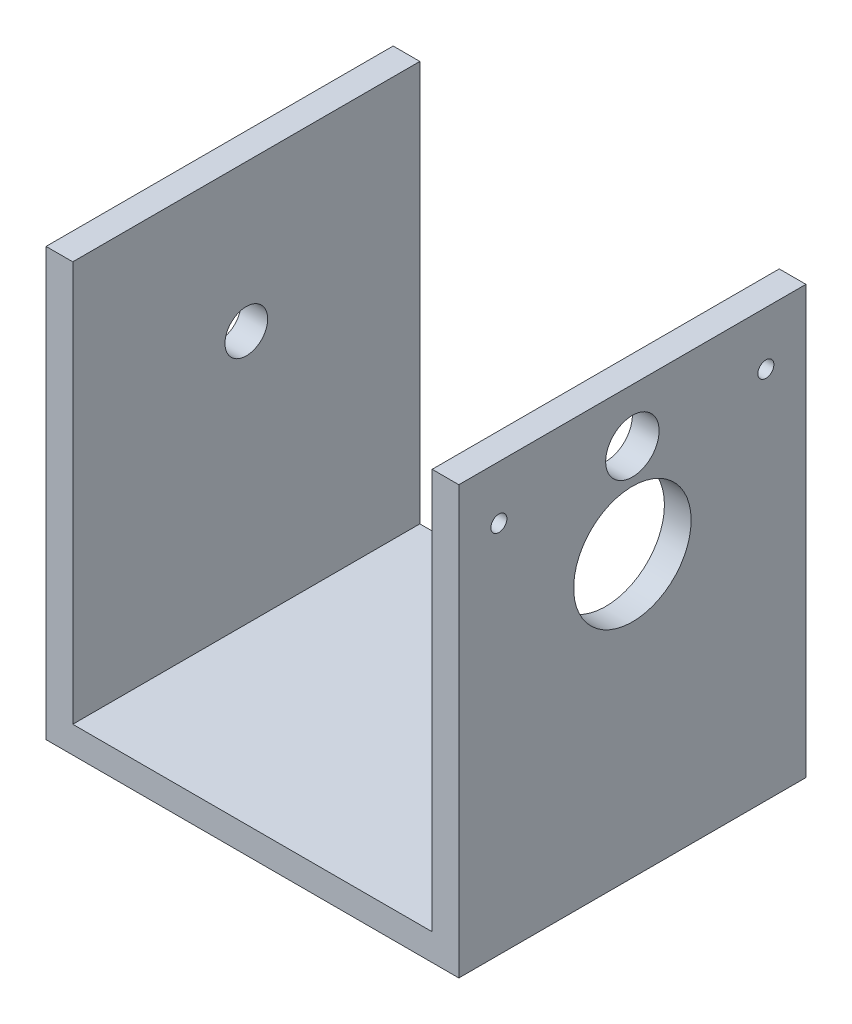
ISO-10303-21;
HEADER;
FILE_DESCRIPTION(('STEP AP214'),'2;1');
FILE_NAME('part.step','',(''),(''),'','','');
FILE_SCHEMA(('AUTOMOTIVE_DESIGN { 1 0 10303 214 1 1 1 1 }'));
ENDSEC;
DATA;
#1=APPLICATION_CONTEXT('core data for automotive mechanical design processes');
#2=APPLICATION_PROTOCOL_DEFINITION('international standard','automotive_design',2000,#1);
#3=PRODUCT_CONTEXT('',#1,'mechanical');
#4=PRODUCT('Part','Part','',(#3));
#5=PRODUCT_RELATED_PRODUCT_CATEGORY('part','',(#4));
#6=PRODUCT_DEFINITION_FORMATION('','',#4);
#7=PRODUCT_DEFINITION_CONTEXT('part definition',#1,'design');
#8=PRODUCT_DEFINITION('design','',#6,#7);
#9=PRODUCT_DEFINITION_SHAPE('','',#8);
#10=(LENGTH_UNIT() NAMED_UNIT(*) SI_UNIT(.MILLI.,.METRE.));
#11=(NAMED_UNIT(*) PLANE_ANGLE_UNIT() SI_UNIT($,.RADIAN.));
#12=(NAMED_UNIT(*) SI_UNIT($,.STERADIAN.) SOLID_ANGLE_UNIT());
#13=UNCERTAINTY_MEASURE_WITH_UNIT(LENGTH_MEASURE(1.E-05),#10,'distance_accuracy_value','');
#14=(GEOMETRIC_REPRESENTATION_CONTEXT(3) GLOBAL_UNCERTAINTY_ASSIGNED_CONTEXT((#13)) GLOBAL_UNIT_ASSIGNED_CONTEXT((#10,
#11,#12)) REPRESENTATION_CONTEXT('',''));
#15=CARTESIAN_POINT('',(0.,0.,0.));
#16=DIRECTION('',(0.,0.,1.));
#17=DIRECTION('',(1.,0.,0.));
#18=AXIS2_PLACEMENT_3D('',#15,#16,#17);
#19=CARTESIAN_POINT('',(0.,-47.5,0.));
#20=DIRECTION('',(0.,1.,0.));
#21=DIRECTION('',(0.,0.,1.));
#22=AXIS2_PLACEMENT_3D('',#19,#20,#21);
#23=PLANE('',#22);
#24=DIRECTION('',(1.,0.,0.));
#25=VECTOR('',#24,1.);
#26=CARTESIAN_POINT('',(0.,-47.5,-37.5));
#27=LINE('',#26,#25);
#28=CARTESIAN_POINT('',(-67.3,-47.5,-37.5));
#29=VERTEX_POINT('',#28);
#30=CARTESIAN_POINT('',(0.,-47.5,-37.5));
#31=VERTEX_POINT('',#30);
#32=EDGE_CURVE('E37',#29,#31,#27,.T.);
#33=ORIENTED_EDGE('',*,*,#32,.F.);
#34=DIRECTION('',(0.,0.,1.));
#35=VECTOR('',#34,1.);
#36=CARTESIAN_POINT('',(-67.3,-47.5,-37.5));
#37=LINE('',#36,#35);
#38=CARTESIAN_POINT('',(-67.3,-47.5,27.5));
#39=VERTEX_POINT('',#38);
#40=EDGE_CURVE('E348',#29,#39,#37,.T.);
#41=ORIENTED_EDGE('',*,*,#40,.T.);
#42=DIRECTION('',(-1.,0.,0.));
#43=VECTOR('',#42,1.);
#44=CARTESIAN_POINT('',(0.,-47.5,27.5));
#45=LINE('',#44,#43);
#46=CARTESIAN_POINT('',(0.,-47.4999999999999,27.5));
#47=VERTEX_POINT('',#46);
#48=EDGE_CURVE('E50',#47,#39,#45,.T.);
#49=ORIENTED_EDGE('',*,*,#48,.F.);
#50=DIRECTION('',(0.,0.,1.));
#51=VECTOR('',#50,1.);
#52=CARTESIAN_POINT('',(0.,-47.5,27.5));
#53=LINE('',#52,#51);
#54=EDGE_CURVE('E78',#31,#47,#53,.T.);
#55=ORIENTED_EDGE('',*,*,#54,.F.);
#56=EDGE_LOOP('',(#33,#41,#49,#55));
#57=FACE_BOUND('',#56,.T.);
#58=ADVANCED_FACE('F33',(#57),#23,.T.);
#59=CARTESIAN_POINT('',(5.,0.,0.));
#60=DIRECTION('',(1.,0.,0.));
#61=DIRECTION('',(0.,0.,-1.));
#62=AXIS2_PLACEMENT_3D('',#59,#60,#61);
#63=PLANE('',#62);
#64=CARTESIAN_POINT('',(5.,17.5,-30.));
#65=DIRECTION('',(1.,0.,0.));
#66=DIRECTION('',(0.,0.,-1.));
#67=AXIS2_PLACEMENT_3D('',#64,#65,#66);
#68=CIRCLE('',#67,1.50000000000001);
#69=CARTESIAN_POINT('',(5.,17.5,-31.5));
#70=VERTEX_POINT('',#69);
#71=EDGE_CURVE('E113',#70,#70,#68,.T.);
#72=ORIENTED_EDGE('',*,*,#71,.F.);
#73=EDGE_LOOP('',(#72));
#74=FACE_BOUND('',#73,.T.);
#75=CARTESIAN_POINT('',(5.,0.,-4.99999999999999));
#76=DIRECTION('',(1.,0.,0.));
#77=DIRECTION('',(0.,0.,-1.));
#78=AXIS2_PLACEMENT_3D('',#75,#76,#77);
#79=CIRCLE('',#78,11.);
#80=CARTESIAN_POINT('',(5.,0.,-16.));
#81=VERTEX_POINT('',#80);
#82=EDGE_CURVE('E98',#81,#81,#79,.T.);
#83=ORIENTED_EDGE('',*,*,#82,.F.);
#84=EDGE_LOOP('',(#83));
#85=FACE_BOUND('',#84,.T.);
#86=DIRECTION('',(0.,1.,0.));
#87=VECTOR('',#86,1.);
#88=CARTESIAN_POINT('',(5.,7.50000000000006,-37.5));
#89=LINE('',#88,#87);
#90=CARTESIAN_POINT('',(5.,-52.5,-37.5));
#91=VERTEX_POINT('',#90);
#92=CARTESIAN_POINT('',(5.,27.5,-37.5));
#93=VERTEX_POINT('',#92);
#94=EDGE_CURVE('E81',#91,#93,#89,.T.);
#95=ORIENTED_EDGE('',*,*,#94,.T.);
#96=DIRECTION('',(0.,0.,1.));
#97=VECTOR('',#96,1.);
#98=CARTESIAN_POINT('',(5.,27.5,-37.5));
#99=LINE('',#98,#97);
#100=CARTESIAN_POINT('',(5.,27.5,27.5));
#101=VERTEX_POINT('',#100);
#102=EDGE_CURVE('E59',#93,#101,#99,.T.);
#103=ORIENTED_EDGE('',*,*,#102,.T.);
#104=DIRECTION('',(0.,-1.,0.));
#105=VECTOR('',#104,1.);
#106=CARTESIAN_POINT('',(5.,27.5,27.5));
#107=LINE('',#106,#105);
#108=CARTESIAN_POINT('',(5.,-52.5,27.5));
#109=VERTEX_POINT('',#108);
#110=EDGE_CURVE('E91',#101,#109,#107,.T.);
#111=ORIENTED_EDGE('',*,*,#110,.T.);
#112=DIRECTION('',(0.,0.,1.));
#113=VECTOR('',#112,1.);
#114=CARTESIAN_POINT('',(5.,-52.5,27.5));
#115=LINE('',#114,#113);
#116=EDGE_CURVE('E130',#91,#109,#115,.T.);
#117=ORIENTED_EDGE('',*,*,#116,.F.);
#118=EDGE_LOOP('',(#95,#103,#111,#117));
#119=FACE_BOUND('',#118,.T.);
#120=CARTESIAN_POINT('',(5.,17.5,-4.99999999999999));
#121=DIRECTION('',(1.,0.,0.));
#122=DIRECTION('',(0.,0.,-1.));
#123=AXIS2_PLACEMENT_3D('',#120,#121,#122);
#124=CIRCLE('',#123,5.);
#125=CARTESIAN_POINT('',(5.,17.5,-9.99999999999999));
#126=VERTEX_POINT('',#125);
#127=EDGE_CURVE('E107',#126,#126,#124,.T.);
#128=ORIENTED_EDGE('',*,*,#127,.F.);
#129=EDGE_LOOP('',(#128));
#130=FACE_BOUND('',#129,.T.);
#131=CARTESIAN_POINT('',(5.,17.5,20.));
#132=DIRECTION('',(1.,0.,0.));
#133=DIRECTION('',(0.,0.,-1.));
#134=AXIS2_PLACEMENT_3D('',#131,#132,#133);
#135=CIRCLE('',#134,1.5);
#136=CARTESIAN_POINT('',(5.,17.5,18.5));
#137=VERTEX_POINT('',#136);
#138=EDGE_CURVE('E119',#137,#137,#135,.T.);
#139=ORIENTED_EDGE('',*,*,#138,.F.);
#140=EDGE_LOOP('',(#139));
#141=FACE_BOUND('',#140,.T.);
#142=ADVANCED_FACE('F170',(#74,#85,#119,#130,#141),#63,.T.);
#143=CARTESIAN_POINT('',(0.,0.,0.));
#144=DIRECTION('',(1.,0.,0.));
#145=DIRECTION('',(0.,0.,-1.));
#146=AXIS2_PLACEMENT_3D('',#143,#144,#145);
#147=PLANE('',#146);
#148=CARTESIAN_POINT('',(0.,17.5,-30.));
#149=DIRECTION('',(1.,0.,0.));
#150=DIRECTION('',(0.,0.,-1.));
#151=AXIS2_PLACEMENT_3D('',#148,#149,#150);
#152=CIRCLE('',#151,1.50000000000001);
#153=CARTESIAN_POINT('',(0.,17.5,-31.5));
#154=VERTEX_POINT('',#153);
#155=EDGE_CURVE('E116',#154,#154,#152,.T.);
#156=ORIENTED_EDGE('',*,*,#155,.T.);
#157=EDGE_LOOP('',(#156));
#158=FACE_BOUND('',#157,.T.);
#159=CARTESIAN_POINT('',(0.,0.,-4.99999999999999));
#160=DIRECTION('',(1.,0.,0.));
#161=DIRECTION('',(0.,0.,-1.));
#162=AXIS2_PLACEMENT_3D('',#159,#160,#161);
#163=CIRCLE('',#162,11.);
#164=CARTESIAN_POINT('',(0.,0.,-16.));
#165=VERTEX_POINT('',#164);
#166=EDGE_CURVE('E104',#165,#165,#163,.T.);
#167=ORIENTED_EDGE('',*,*,#166,.T.);
#168=EDGE_LOOP('',(#167));
#169=FACE_BOUND('',#168,.T.);
#170=DIRECTION('',(0.,1.,0.));
#171=VECTOR('',#170,1.);
#172=CARTESIAN_POINT('',(0.,7.50000000000006,-37.5));
#173=LINE('',#172,#171);
#174=CARTESIAN_POINT('',(0.,27.5,-37.5));
#175=VERTEX_POINT('',#174);
#176=EDGE_CURVE('E87',#31,#175,#173,.T.);
#177=ORIENTED_EDGE('',*,*,#176,.F.);
#178=ORIENTED_EDGE('',*,*,#54,.T.);
#179=DIRECTION('',(0.,-1.,0.));
#180=VECTOR('',#179,1.);
#181=CARTESIAN_POINT('',(0.,17.5,27.5));
#182=LINE('',#181,#180);
#183=CARTESIAN_POINT('',(0.,27.5,27.5));
#184=VERTEX_POINT('',#183);
#185=EDGE_CURVE('E72',#184,#47,#182,.T.);
#186=ORIENTED_EDGE('',*,*,#185,.F.);
#187=DIRECTION('',(0.,0.,1.));
#188=VECTOR('',#187,1.);
#189=CARTESIAN_POINT('',(0.,27.5,17.5000000000001));
#190=LINE('',#189,#188);
#191=EDGE_CURVE('E77',#175,#184,#190,.T.);
#192=ORIENTED_EDGE('',*,*,#191,.F.);
#193=EDGE_LOOP('',(#177,#178,#186,#192));
#194=FACE_BOUND('',#193,.T.);
#195=CARTESIAN_POINT('',(0.,17.5,-4.99999999999999));
#196=DIRECTION('',(1.,0.,0.));
#197=DIRECTION('',(0.,0.,-1.));
#198=AXIS2_PLACEMENT_3D('',#195,#196,#197);
#199=CIRCLE('',#198,5.);
#200=CARTESIAN_POINT('',(0.,17.5,-9.99999999999999));
#201=VERTEX_POINT('',#200);
#202=EDGE_CURVE('E110',#201,#201,#199,.T.);
#203=ORIENTED_EDGE('',*,*,#202,.T.);
#204=EDGE_LOOP('',(#203));
#205=FACE_BOUND('',#204,.T.);
#206=CARTESIAN_POINT('',(0.,17.5,20.));
#207=DIRECTION('',(1.,0.,0.));
#208=DIRECTION('',(0.,0.,-1.));
#209=AXIS2_PLACEMENT_3D('',#206,#207,#208);
#210=CIRCLE('',#209,1.5);
#211=CARTESIAN_POINT('',(0.,17.5,18.5));
#212=VERTEX_POINT('',#211);
#213=EDGE_CURVE('E122',#212,#212,#210,.T.);
#214=ORIENTED_EDGE('',*,*,#213,.T.);
#215=EDGE_LOOP('',(#214));
#216=FACE_BOUND('',#215,.T.);
#217=ADVANCED_FACE('F75',(#158,#169,#194,#205,#216),#147,.F.);
#218=CARTESIAN_POINT('',(5.,7.50000000000006,-37.5));
#219=DIRECTION('',(0.,0.,1.));
#220=DIRECTION('',(1.,0.,0.));
#221=AXIS2_PLACEMENT_3D('',#218,#219,#220);
#222=PLANE('',#221);
#223=DIRECTION('',(1.,0.,0.));
#224=VECTOR('',#223,1.);
#225=CARTESIAN_POINT('',(0.,-52.5,-37.5));
#226=LINE('',#225,#224);
#227=CARTESIAN_POINT('',(-72.3,-52.5,-37.5));
#228=VERTEX_POINT('',#227);
#229=EDGE_CURVE('E133',#228,#91,#226,.T.);
#230=ORIENTED_EDGE('',*,*,#229,.F.);
#231=DIRECTION('',(0.,-1.,0.));
#232=VECTOR('',#231,1.);
#233=CARTESIAN_POINT('',(-72.3,-47.5,-37.5));
#234=LINE('',#233,#232);
#235=CARTESIAN_POINT('',(-72.3,27.5,-37.5));
#236=VERTEX_POINT('',#235);
#237=EDGE_CURVE('E136',#236,#228,#234,.T.);
#238=ORIENTED_EDGE('',*,*,#237,.F.);
#239=DIRECTION('',(-1.,0.,0.));
#240=VECTOR('',#239,1.);
#241=CARTESIAN_POINT('',(-67.3,27.5,-37.5));
#242=LINE('',#241,#240);
#243=CARTESIAN_POINT('',(-67.3,27.5,-37.5));
#244=VERTEX_POINT('',#243);
#245=EDGE_CURVE('E145',#244,#236,#242,.T.);
#246=ORIENTED_EDGE('',*,*,#245,.F.);
#247=DIRECTION('',(0.,-1.,0.));
#248=VECTOR('',#247,1.);
#249=CARTESIAN_POINT('',(-67.3,27.5,-37.5));
#250=LINE('',#249,#248);
#251=EDGE_CURVE('E165',#244,#29,#250,.T.);
#252=ORIENTED_EDGE('',*,*,#251,.T.);
#253=ORIENTED_EDGE('',*,*,#32,.T.);
#254=ORIENTED_EDGE('',*,*,#176,.T.);
#255=DIRECTION('',(-1.,0.,0.));
#256=VECTOR('',#255,1.);
#257=CARTESIAN_POINT('',(5.,27.5,-37.5));
#258=LINE('',#257,#256);
#259=EDGE_CURVE('E11',#93,#175,#258,.T.);
#260=ORIENTED_EDGE('',*,*,#259,.F.);
#261=ORIENTED_EDGE('',*,*,#94,.F.);
#262=EDGE_LOOP('',(#230,#238,#246,#252,#253,#254,#260,#261));
#263=FACE_BOUND('',#262,.T.);
#264=ADVANCED_FACE('F35',(#263),#222,.F.);
#265=CARTESIAN_POINT('',(5.,27.5,17.5000000000001));
#266=DIRECTION('',(0.,-1.,0.));
#267=DIRECTION('',(0.,0.,-1.));
#268=AXIS2_PLACEMENT_3D('',#265,#266,#267);
#269=PLANE('',#268);
#270=ORIENTED_EDGE('',*,*,#191,.T.);
#271=DIRECTION('',(-1.,0.,0.));
#272=VECTOR('',#271,1.);
#273=CARTESIAN_POINT('',(5.,27.5,27.5));
#274=LINE('',#273,#272);
#275=EDGE_CURVE('E42',#101,#184,#274,.T.);
#276=ORIENTED_EDGE('',*,*,#275,.F.);
#277=ORIENTED_EDGE('',*,*,#102,.F.);
#278=ORIENTED_EDGE('',*,*,#259,.T.);
#279=EDGE_LOOP('',(#270,#276,#277,#278));
#280=FACE_BOUND('',#279,.T.);
#281=ADVANCED_FACE('F84',(#280),#269,.F.);
#282=CARTESIAN_POINT('',(5.,17.5,27.5));
#283=DIRECTION('',(0.,0.,-1.));
#284=DIRECTION('',(0.,1.,0.));
#285=AXIS2_PLACEMENT_3D('',#282,#283,#284);
#286=PLANE('',#285);
#287=ORIENTED_EDGE('',*,*,#185,.T.);
#288=ORIENTED_EDGE('',*,*,#48,.T.);
#289=DIRECTION('',(0.,1.,0.));
#290=VECTOR('',#289,1.);
#291=CARTESIAN_POINT('',(-67.3,-47.5,27.5));
#292=LINE('',#291,#290);
#293=CARTESIAN_POINT('',(-67.3,27.5,27.5));
#294=VERTEX_POINT('',#293);
#295=EDGE_CURVE('E350',#39,#294,#292,.T.);
#296=ORIENTED_EDGE('',*,*,#295,.T.);
#297=DIRECTION('',(-1.,0.,0.));
#298=VECTOR('',#297,1.);
#299=CARTESIAN_POINT('',(-67.3,27.5,27.5));
#300=LINE('',#299,#298);
#301=CARTESIAN_POINT('',(-72.3,27.5,27.5));
#302=VERTEX_POINT('',#301);
#303=EDGE_CURVE('E148',#294,#302,#300,.T.);
#304=ORIENTED_EDGE('',*,*,#303,.T.);
#305=DIRECTION('',(0.,-1.,0.));
#306=VECTOR('',#305,1.);
#307=CARTESIAN_POINT('',(-72.3,-47.5,27.5));
#308=LINE('',#307,#306);
#309=CARTESIAN_POINT('',(-72.3,-52.5,27.5));
#310=VERTEX_POINT('',#309);
#311=EDGE_CURVE('E137',#302,#310,#308,.T.);
#312=ORIENTED_EDGE('',*,*,#311,.T.);
#313=DIRECTION('',(-1.,0.,0.));
#314=VECTOR('',#313,1.);
#315=CARTESIAN_POINT('',(0.,-52.5,27.5));
#316=LINE('',#315,#314);
#317=EDGE_CURVE('E125',#109,#310,#316,.T.);
#318=ORIENTED_EDGE('',*,*,#317,.F.);
#319=ORIENTED_EDGE('',*,*,#110,.F.);
#320=ORIENTED_EDGE('',*,*,#275,.T.);
#321=EDGE_LOOP('',(#287,#288,#296,#304,#312,#318,#319,#320));
#322=FACE_BOUND('',#321,.T.);
#323=ADVANCED_FACE('F89',(#322),#286,.F.);
#324=CARTESIAN_POINT('',(5.,0.,-4.99999999999999));
#325=DIRECTION('',(-1.,0.,0.));
#326=DIRECTION('',(0.,0.,1.));
#327=AXIS2_PLACEMENT_3D('',#324,#325,#326);
#328=CYLINDRICAL_SURFACE('',#327,11.);
#329=ORIENTED_EDGE('',*,*,#82,.T.);
#330=EDGE_LOOP('',(#329));
#331=FACE_BOUND('',#330,.T.);
#332=ORIENTED_EDGE('',*,*,#166,.F.);
#333=EDGE_LOOP('',(#332));
#334=FACE_BOUND('',#333,.T.);
#335=ADVANCED_FACE('F200',(#331,#334),#328,.F.);
#336=CARTESIAN_POINT('',(5.,17.5,-4.99999999999999));
#337=DIRECTION('',(-1.,0.,0.));
#338=DIRECTION('',(0.,0.,1.));
#339=AXIS2_PLACEMENT_3D('',#336,#337,#338);
#340=CYLINDRICAL_SURFACE('',#339,5.);
#341=ORIENTED_EDGE('',*,*,#127,.T.);
#342=EDGE_LOOP('',(#341));
#343=FACE_BOUND('',#342,.T.);
#344=ORIENTED_EDGE('',*,*,#202,.F.);
#345=EDGE_LOOP('',(#344));
#346=FACE_BOUND('',#345,.T.);
#347=ADVANCED_FACE('F196',(#343,#346),#340,.F.);
#348=CARTESIAN_POINT('',(5.,17.5,-30.));
#349=DIRECTION('',(-1.,0.,0.));
#350=DIRECTION('',(0.,0.,1.));
#351=AXIS2_PLACEMENT_3D('',#348,#349,#350);
#352=CYLINDRICAL_SURFACE('',#351,1.50000000000001);
#353=ORIENTED_EDGE('',*,*,#71,.T.);
#354=EDGE_LOOP('',(#353));
#355=FACE_BOUND('',#354,.T.);
#356=ORIENTED_EDGE('',*,*,#155,.F.);
#357=EDGE_LOOP('',(#356));
#358=FACE_BOUND('',#357,.T.);
#359=ADVANCED_FACE('F192',(#355,#358),#352,.F.);
#360=CARTESIAN_POINT('',(5.,17.5,20.));
#361=DIRECTION('',(-1.,0.,0.));
#362=DIRECTION('',(0.,0.,1.));
#363=AXIS2_PLACEMENT_3D('',#360,#361,#362);
#364=CYLINDRICAL_SURFACE('',#363,1.5);
#365=ORIENTED_EDGE('',*,*,#138,.T.);
#366=EDGE_LOOP('',(#365));
#367=FACE_BOUND('',#366,.T.);
#368=ORIENTED_EDGE('',*,*,#213,.F.);
#369=EDGE_LOOP('',(#368));
#370=FACE_BOUND('',#369,.T.);
#371=ADVANCED_FACE('F188',(#367,#370),#364,.F.);
#372=CARTESIAN_POINT('',(0.,-52.5,0.));
#373=DIRECTION('',(0.,-1.,0.));
#374=DIRECTION('',(0.,0.,-1.));
#375=AXIS2_PLACEMENT_3D('',#372,#373,#374);
#376=PLANE('',#375);
#377=ORIENTED_EDGE('',*,*,#317,.T.);
#378=DIRECTION('',(0.,0.,-1.));
#379=VECTOR('',#378,1.);
#380=CARTESIAN_POINT('',(-72.3,-52.5,27.5));
#381=LINE('',#380,#379);
#382=EDGE_CURVE('E142',#310,#228,#381,.T.);
#383=ORIENTED_EDGE('',*,*,#382,.T.);
#384=ORIENTED_EDGE('',*,*,#229,.T.);
#385=ORIENTED_EDGE('',*,*,#116,.T.);
#386=EDGE_LOOP('',(#377,#383,#384,#385));
#387=FACE_BOUND('',#386,.T.);
#388=ADVANCED_FACE('F184',(#387),#376,.T.);
#389=CARTESIAN_POINT('',(-72.3,-47.5,27.5));
#390=DIRECTION('',(-1.,0.,0.));
#391=DIRECTION('',(0.,0.,1.));
#392=AXIS2_PLACEMENT_3D('',#389,#390,#391);
#393=PLANE('',#392);
#394=ORIENTED_EDGE('',*,*,#382,.F.);
#395=ORIENTED_EDGE('',*,*,#311,.F.);
#396=DIRECTION('',(0.,0.,-1.));
#397=VECTOR('',#396,1.);
#398=CARTESIAN_POINT('',(-72.3,27.5,27.5));
#399=LINE('',#398,#397);
#400=EDGE_CURVE('E344',#302,#236,#399,.T.);
#401=ORIENTED_EDGE('',*,*,#400,.T.);
#402=ORIENTED_EDGE('',*,*,#237,.T.);
#403=EDGE_LOOP('',(#394,#395,#401,#402));
#404=FACE_BOUND('',#403,.T.);
#405=CARTESIAN_POINT('',(-72.3,0.,-5.00000000000001));
#406=DIRECTION('',(-1.,0.,0.));
#407=DIRECTION('',(0.,0.,1.));
#408=AXIS2_PLACEMENT_3D('',#405,#406,#407);
#409=CIRCLE('',#408,4.);
#410=CARTESIAN_POINT('',(-72.3,0.,-1.00000000000001));
#411=VERTEX_POINT('',#410);
#412=EDGE_CURVE('E341',#411,#411,#409,.T.);
#413=ORIENTED_EDGE('',*,*,#412,.F.);
#414=EDGE_LOOP('',(#413));
#415=FACE_BOUND('',#414,.T.);
#416=ADVANCED_FACE('F181',(#404,#415),#393,.T.);
#417=CARTESIAN_POINT('',(-67.3,27.5,27.5));
#418=DIRECTION('',(0.,1.,0.));
#419=DIRECTION('',(0.,0.,1.));
#420=AXIS2_PLACEMENT_3D('',#417,#418,#419);
#421=PLANE('',#420);
#422=ORIENTED_EDGE('',*,*,#400,.F.);
#423=ORIENTED_EDGE('',*,*,#303,.F.);
#424=DIRECTION('',(0.,0.,-1.));
#425=VECTOR('',#424,1.);
#426=CARTESIAN_POINT('',(-67.3,27.5,27.5));
#427=LINE('',#426,#425);
#428=EDGE_CURVE('E352',#294,#244,#427,.T.);
#429=ORIENTED_EDGE('',*,*,#428,.T.);
#430=ORIENTED_EDGE('',*,*,#245,.T.);
#431=EDGE_LOOP('',(#422,#423,#429,#430));
#432=FACE_BOUND('',#431,.T.);
#433=ADVANCED_FACE('F179',(#432),#421,.T.);
#434=CARTESIAN_POINT('',(-67.3,0.,0.));
#435=DIRECTION('',(-1.,0.,0.));
#436=DIRECTION('',(0.,0.,1.));
#437=AXIS2_PLACEMENT_3D('',#434,#435,#436);
#438=PLANE('',#437);
#439=CARTESIAN_POINT('',(-67.3,0.,-5.00000000000001));
#440=DIRECTION('',(-1.,0.,0.));
#441=DIRECTION('',(0.,0.,1.));
#442=AXIS2_PLACEMENT_3D('',#439,#440,#441);
#443=CIRCLE('',#442,4.);
#444=CARTESIAN_POINT('',(-67.3,0.,-1.00000000000001));
#445=VERTEX_POINT('',#444);
#446=EDGE_CURVE('E338',#445,#445,#443,.T.);
#447=ORIENTED_EDGE('',*,*,#446,.T.);
#448=EDGE_LOOP('',(#447));
#449=FACE_BOUND('',#448,.T.);
#450=ORIENTED_EDGE('',*,*,#251,.F.);
#451=ORIENTED_EDGE('',*,*,#428,.F.);
#452=ORIENTED_EDGE('',*,*,#295,.F.);
#453=ORIENTED_EDGE('',*,*,#40,.F.);
#454=EDGE_LOOP('',(#450,#451,#452,#453));
#455=FACE_BOUND('',#454,.T.);
#456=ADVANCED_FACE('F310',(#449,#455),#438,.F.);
#457=CARTESIAN_POINT('',(-67.3,0.,-5.00000000000001));
#458=DIRECTION('',(-1.,0.,0.));
#459=DIRECTION('',(0.,0.,1.));
#460=AXIS2_PLACEMENT_3D('',#457,#458,#459);
#461=CYLINDRICAL_SURFACE('',#460,4.);
#462=ORIENTED_EDGE('',*,*,#446,.F.);
#463=EDGE_LOOP('',(#462));
#464=FACE_BOUND('',#463,.T.);
#465=ORIENTED_EDGE('',*,*,#412,.T.);
#466=EDGE_LOOP('',(#465));
#467=FACE_BOUND('',#466,.T.);
#468=ADVANCED_FACE('F318',(#464,#467),#461,.F.);
#469=CLOSED_SHELL('',(#58,#142,#217,#264,#281,#323,#335,#347,#359,#371,#388,#416,#433,#456,#468));
#470=MANIFOLD_SOLID_BREP('B2',#469);
#471=ADVANCED_BREP_SHAPE_REPRESENTATION('',(#18,#470),#14);
#472=SHAPE_DEFINITION_REPRESENTATION(#9,#471);
ENDSEC;
END-ISO-10303-21;
